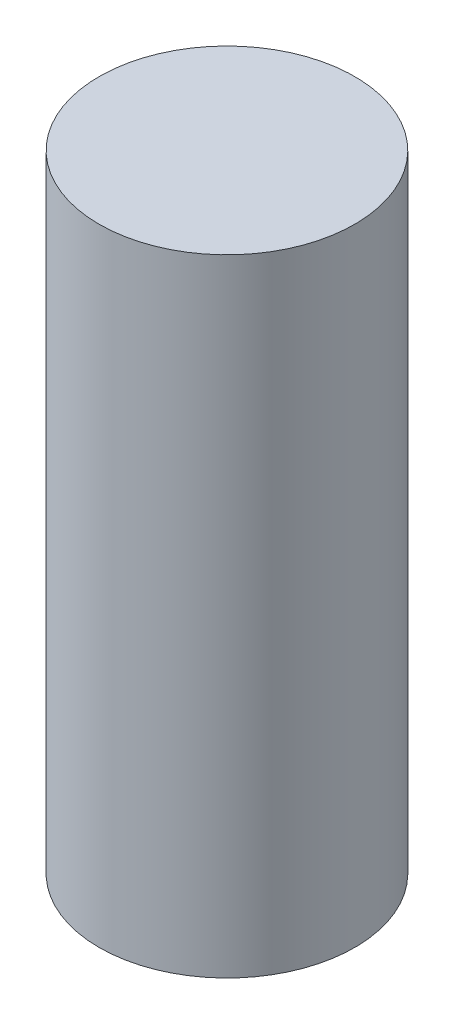
ISO-10303-21;
HEADER;
FILE_DESCRIPTION(('STEP AP214'),'2;1');
FILE_NAME('part.step','',(''),(''),'','','');
FILE_SCHEMA(('AUTOMOTIVE_DESIGN { 1 0 10303 214 1 1 1 1 }'));
ENDSEC;
DATA;
#1=APPLICATION_CONTEXT('core data for automotive mechanical design processes');
#2=APPLICATION_PROTOCOL_DEFINITION('international standard','automotive_design',2000,#1);
#3=PRODUCT_CONTEXT('',#1,'mechanical');
#4=PRODUCT('Part','Part','',(#3));
#5=PRODUCT_RELATED_PRODUCT_CATEGORY('part','',(#4));
#6=PRODUCT_DEFINITION_FORMATION('','',#4);
#7=PRODUCT_DEFINITION_CONTEXT('part definition',#1,'design');
#8=PRODUCT_DEFINITION('design','',#6,#7);
#9=PRODUCT_DEFINITION_SHAPE('','',#8);
#10=(LENGTH_UNIT() NAMED_UNIT(*) SI_UNIT(.MILLI.,.METRE.));
#11=(NAMED_UNIT(*) PLANE_ANGLE_UNIT() SI_UNIT($,.RADIAN.));
#12=(NAMED_UNIT(*) SI_UNIT($,.STERADIAN.) SOLID_ANGLE_UNIT());
#13=UNCERTAINTY_MEASURE_WITH_UNIT(LENGTH_MEASURE(1.E-05),#10,'distance_accuracy_value','');
#14=(GEOMETRIC_REPRESENTATION_CONTEXT(3) GLOBAL_UNCERTAINTY_ASSIGNED_CONTEXT((#13)) GLOBAL_UNIT_ASSIGNED_CONTEXT((#10,
#11,#12)) REPRESENTATION_CONTEXT('',''));
#15=CARTESIAN_POINT('',(0.,0.,0.));
#16=DIRECTION('',(0.,0.,1.));
#17=DIRECTION('',(1.,0.,0.));
#18=AXIS2_PLACEMENT_3D('',#15,#16,#17);
#19=CARTESIAN_POINT('',(0.,12.,0.));
#20=DIRECTION('',(0.,-1.,0.));
#21=DIRECTION('',(0.,0.,-1.));
#22=AXIS2_PLACEMENT_3D('',#19,#20,#21);
#23=CYLINDRICAL_SURFACE('',#22,2.45);
#24=CARTESIAN_POINT('',(0.,12.,0.));
#25=DIRECTION('',(0.,1.,0.));
#26=DIRECTION('',(0.,0.,1.));
#27=AXIS2_PLACEMENT_3D('',#24,#25,#26);
#28=CIRCLE('',#27,2.45);
#29=CARTESIAN_POINT('',(0.,12.,2.45));
#30=VERTEX_POINT('',#29);
#31=EDGE_CURVE('E10',#30,#30,#28,.T.);
#32=ORIENTED_EDGE('',*,*,#31,.F.);
#33=EDGE_LOOP('',(#32));
#34=FACE_BOUND('',#33,.T.);
#35=CARTESIAN_POINT('',(0.,0.,0.));
#36=DIRECTION('',(0.,1.,0.));
#37=DIRECTION('',(0.,0.,1.));
#38=AXIS2_PLACEMENT_3D('',#35,#36,#37);
#39=CIRCLE('',#38,2.45);
#40=CARTESIAN_POINT('',(0.,0.,2.45));
#41=VERTEX_POINT('',#40);
#42=EDGE_CURVE('E46',#41,#41,#39,.T.);
#43=ORIENTED_EDGE('',*,*,#42,.T.);
#44=EDGE_LOOP('',(#43));
#45=FACE_BOUND('',#44,.T.);
#46=ADVANCED_FACE('F43',(#34,#45),#23,.T.);
#47=CARTESIAN_POINT('',(0.,12.,0.));
#48=DIRECTION('',(0.,1.,0.));
#49=DIRECTION('',(0.,0.,1.));
#50=AXIS2_PLACEMENT_3D('',#47,#48,#49);
#51=PLANE('',#50);
#52=ORIENTED_EDGE('',*,*,#31,.T.);
#53=EDGE_LOOP('',(#52));
#54=FACE_BOUND('',#53,.T.);
#55=ADVANCED_FACE('F60',(#54),#51,.T.);
#56=CARTESIAN_POINT('',(0.,0.,0.));
#57=DIRECTION('',(0.,1.,0.));
#58=DIRECTION('',(0.,0.,1.));
#59=AXIS2_PLACEMENT_3D('',#56,#57,#58);
#60=PLANE('',#59);
#61=ORIENTED_EDGE('',*,*,#42,.F.);
#62=EDGE_LOOP('',(#61));
#63=FACE_BOUND('',#62,.T.);
#64=ADVANCED_FACE('F58',(#63),#60,.F.);
#65=CLOSED_SHELL('',(#46,#55,#64));
#66=MANIFOLD_SOLID_BREP('B2',#65);
#67=ADVANCED_BREP_SHAPE_REPRESENTATION('',(#18,#66),#14);
#68=SHAPE_DEFINITION_REPRESENTATION(#9,#67);
ENDSEC;
END-ISO-10303-21;
